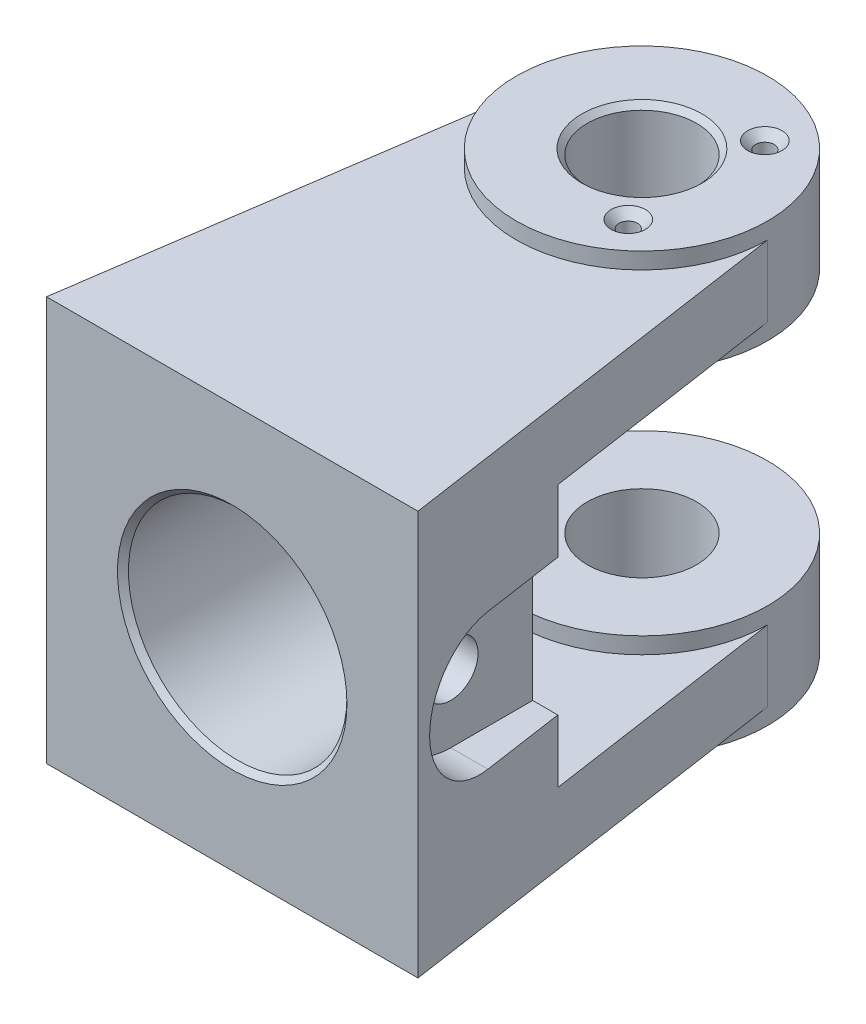
ISO-10303-21;
HEADER;
FILE_DESCRIPTION(('STEP AP214'),'2;1');
FILE_NAME('part.step','',(''),(''),'','','');
FILE_SCHEMA(('AUTOMOTIVE_DESIGN { 1 0 10303 214 1 1 1 1 }'));
ENDSEC;
DATA;
#1=APPLICATION_CONTEXT('core data for automotive mechanical design processes');
#2=APPLICATION_PROTOCOL_DEFINITION('international standard','automotive_design',2000,#1);
#3=PRODUCT_CONTEXT('',#1,'mechanical');
#4=PRODUCT('Part','Part','',(#3));
#5=PRODUCT_RELATED_PRODUCT_CATEGORY('part','',(#4));
#6=PRODUCT_DEFINITION_FORMATION('','',#4);
#7=PRODUCT_DEFINITION_CONTEXT('part definition',#1,'design');
#8=PRODUCT_DEFINITION('design','',#6,#7);
#9=PRODUCT_DEFINITION_SHAPE('','',#8);
#10=(LENGTH_UNIT() NAMED_UNIT(*) SI_UNIT(.MILLI.,.METRE.));
#11=(NAMED_UNIT(*) PLANE_ANGLE_UNIT() SI_UNIT($,.RADIAN.));
#12=(NAMED_UNIT(*) SI_UNIT($,.STERADIAN.) SOLID_ANGLE_UNIT());
#13=UNCERTAINTY_MEASURE_WITH_UNIT(LENGTH_MEASURE(1.E-05),#10,'distance_accuracy_value','');
#14=(GEOMETRIC_REPRESENTATION_CONTEXT(3) GLOBAL_UNCERTAINTY_ASSIGNED_CONTEXT((#13)) GLOBAL_UNIT_ASSIGNED_CONTEXT((#10,
#11,#12)) REPRESENTATION_CONTEXT('',''));
#15=CARTESIAN_POINT('',(0.,0.,0.));
#16=DIRECTION('',(0.,0.,1.));
#17=DIRECTION('',(1.,0.,0.));
#18=AXIS2_PLACEMENT_3D('',#15,#16,#17);
#19=CARTESIAN_POINT('',(22.5156630699617,6.5,-3.30229725026105));
#20=DIRECTION('',(0.989414914283705,0.,-0.145114187428277));
#21=DIRECTION('',(-0.145114187428277,0.,-0.989414914283705));
#22=AXIS2_PLACEMENT_3D('',#19,#20,#21);
#23=PLANE('',#22);
#24=DIRECTION('',(0.,-1.,0.));
#25=VECTOR('',#24,1.);
#26=CARTESIAN_POINT('',(29.6,30.5,45.));
#27=LINE('',#26,#25);
#28=CARTESIAN_POINT('',(29.6,17.9999999999723,45.0000000000159));
#29=VERTEX_POINT('',#28);
#30=CARTESIAN_POINT('',(29.6,6.5,45.));
#31=VERTEX_POINT('',#30);
#32=EDGE_CURVE('E67',#29,#31,#27,.T.);
#33=ORIENTED_EDGE('',*,*,#32,.F.);
#34=DIRECTION('',(0.145114187428277,0.,0.989414914283705));
#35=VECTOR('',#34,1.);
#36=CARTESIAN_POINT('',(22.5156630699617,17.9999999999723,-3.30229725026105));
#37=LINE('',#36,#35);
#38=CARTESIAN_POINT('',(31.8000000000003,18.,60.0000000000023));
#39=VERTEX_POINT('',#38);
#40=EDGE_CURVE('E178',#29,#39,#37,.T.);
#41=ORIENTED_EDGE('',*,*,#40,.T.);
#42=CARTESIAN_POINT('',(31.8,30.5,60.));
#43=DIRECTION('',(0.989414914283705,0.,-0.145114187428277));
#44=DIRECTION('',(0.145114187428277,0.,0.989414914283705));
#45=AXIS2_PLACEMENT_3D('',#42,#43,#44);
#46=ELLIPSE('',#45,12.6337291054982,12.5);
#47=CARTESIAN_POINT('',(31.8000000000003,43.0000000000064,60.0000000000023));
#48=VERTEX_POINT('',#47);
#49=EDGE_CURVE('E161',#48,#39,#46,.T.);
#50=ORIENTED_EDGE('',*,*,#49,.F.);
#51=DIRECTION('',(0.145114187428277,0.,0.989414914283705));
#52=VECTOR('',#51,1.);
#53=CARTESIAN_POINT('',(22.5156630699617,43.0000000000064,-3.30229725026105));
#54=LINE('',#53,#52);
#55=CARTESIAN_POINT('',(29.6,43.0000000000064,45.0000000000159));
#56=VERTEX_POINT('',#55);
#57=EDGE_CURVE('E162',#56,#48,#54,.T.);
#58=ORIENTED_EDGE('',*,*,#57,.F.);
#59=CARTESIAN_POINT('',(29.6,54.5,45.));
#60=VERTEX_POINT('',#59);
#61=EDGE_CURVE('E266',#60,#56,#27,.T.);
#62=ORIENTED_EDGE('',*,*,#61,.F.);
#63=DIRECTION('',(0.145114187428277,0.,0.989414914283705));
#64=VECTOR('',#63,1.);
#65=CARTESIAN_POINT('',(22.5156630699617,54.5,-3.30229725026105));
#66=LINE('',#65,#64);
#67=CARTESIAN_POINT('',(23.,54.5,0.));
#68=VERTEX_POINT('',#67);
#69=EDGE_CURVE('E219',#68,#60,#66,.T.);
#70=ORIENTED_EDGE('',*,*,#69,.F.);
#71=DIRECTION('',(0.,1.,0.));
#72=VECTOR('',#71,1.);
#73=CARTESIAN_POINT('',(23.,54.5,0.));
#74=LINE('',#73,#72);
#75=CARTESIAN_POINT('',(23.,67.5,0.));
#76=VERTEX_POINT('',#75);
#77=EDGE_CURVE('E222',#68,#76,#74,.T.);
#78=ORIENTED_EDGE('',*,*,#77,.T.);
#79=DIRECTION('',(0.145114187428277,0.,0.989414914283705));
#80=VECTOR('',#79,1.);
#81=CARTESIAN_POINT('',(22.5156630699617,67.5,-3.30229725026105));
#82=LINE('',#81,#80);
#83=CARTESIAN_POINT('',(34.,67.5,75.));
#84=VERTEX_POINT('',#83);
#85=EDGE_CURVE('E216',#76,#84,#82,.T.);
#86=ORIENTED_EDGE('',*,*,#85,.T.);
#87=DIRECTION('',(0.,-1.,0.));
#88=VECTOR('',#87,1.);
#89=CARTESIAN_POINT('',(34.,6.5,75.));
#90=LINE('',#89,#88);
#91=CARTESIAN_POINT('',(34.,-6.5,75.));
#92=VERTEX_POINT('',#91);
#93=EDGE_CURVE('E300',#84,#92,#90,.T.);
#94=ORIENTED_EDGE('',*,*,#93,.T.);
#95=DIRECTION('',(0.145114187428277,0.,0.989414914283705));
#96=VECTOR('',#95,1.);
#97=CARTESIAN_POINT('',(22.5156630699617,-6.5,-3.30229725026105));
#98=LINE('',#97,#96);
#99=CARTESIAN_POINT('',(23.,-6.5,0.));
#100=VERTEX_POINT('',#99);
#101=EDGE_CURVE('E282',#100,#92,#98,.T.);
#102=ORIENTED_EDGE('',*,*,#101,.F.);
#103=DIRECTION('',(0.,-1.,0.));
#104=VECTOR('',#103,1.);
#105=CARTESIAN_POINT('',(23.,6.5,0.));
#106=LINE('',#105,#104);
#107=CARTESIAN_POINT('',(23.,6.5,0.));
#108=VERTEX_POINT('',#107);
#109=EDGE_CURVE('E288',#108,#100,#106,.T.);
#110=ORIENTED_EDGE('',*,*,#109,.F.);
#111=DIRECTION('',(0.145114187428277,0.,0.989414914283705));
#112=VECTOR('',#111,1.);
#113=CARTESIAN_POINT('',(22.5156630699617,6.5,-3.30229725026105));
#114=LINE('',#113,#112);
#115=EDGE_CURVE('E285',#108,#31,#114,.T.);
#116=ORIENTED_EDGE('',*,*,#115,.T.);
#117=EDGE_LOOP('',(#33,#41,#50,#58,#62,#70,#78,#86,#94,#102,#110,#116));
#118=FACE_BOUND('',#117,.T.);
#119=ADVANCED_FACE('F43',(#118),#23,.T.);
#120=CARTESIAN_POINT('',(-29.6,30.5,45.));
#121=DIRECTION('',(0.,0.,1.));
#122=DIRECTION('',(1.,0.,0.));
#123=AXIS2_PLACEMENT_3D('',#120,#121,#122);
#124=PLANE('',#123);
#125=CARTESIAN_POINT('',(0.,30.5,45.));
#126=DIRECTION('',(0.,0.,1.));
#127=DIRECTION('',(1.,0.,0.));
#128=AXIS2_PLACEMENT_3D('',#125,#126,#127);
#129=CIRCLE('',#128,20.);
#130=CARTESIAN_POINT('',(20.,30.5,45.));
#131=VERTEX_POINT('',#130);
#132=EDGE_CURVE('E180',#131,#131,#129,.T.);
#133=ORIENTED_EDGE('',*,*,#132,.T.);
#134=EDGE_LOOP('',(#133));
#135=FACE_BOUND('',#134,.T.);
#136=DIRECTION('',(1.,0.,0.));
#137=VECTOR('',#136,1.);
#138=CARTESIAN_POINT('',(25.,17.9999999999723,45.0000000000159));
#139=LINE('',#138,#137);
#140=CARTESIAN_POINT('',(25.,17.9999999999723,45.));
#141=VERTEX_POINT('',#140);
#142=EDGE_CURVE('E150',#141,#29,#139,.T.);
#143=ORIENTED_EDGE('',*,*,#142,.T.);
#144=ORIENTED_EDGE('',*,*,#32,.T.);
#145=DIRECTION('',(-1.,0.,0.));
#146=VECTOR('',#145,1.);
#147=CARTESIAN_POINT('',(-29.6,6.5,45.));
#148=LINE('',#147,#146);
#149=CARTESIAN_POINT('',(-29.6,6.5,45.));
#150=VERTEX_POINT('',#149);
#151=EDGE_CURVE('E261',#31,#150,#148,.T.);
#152=ORIENTED_EDGE('',*,*,#151,.T.);
#153=DIRECTION('',(0.,-1.,0.));
#154=VECTOR('',#153,1.);
#155=CARTESIAN_POINT('',(-29.6,30.5,45.));
#156=LINE('',#155,#154);
#157=CARTESIAN_POINT('',(-29.6,54.5,45.));
#158=VERTEX_POINT('',#157);
#159=EDGE_CURVE('E263',#158,#150,#156,.T.);
#160=ORIENTED_EDGE('',*,*,#159,.F.);
#161=DIRECTION('',(-1.,0.,0.));
#162=VECTOR('',#161,1.);
#163=CARTESIAN_POINT('',(-29.6,54.5,45.));
#164=LINE('',#163,#162);
#165=EDGE_CURVE('E199',#60,#158,#164,.T.);
#166=ORIENTED_EDGE('',*,*,#165,.F.);
#167=ORIENTED_EDGE('',*,*,#61,.T.);
#168=DIRECTION('',(1.,0.,0.));
#169=VECTOR('',#168,1.);
#170=CARTESIAN_POINT('',(25.,43.0000000000064,45.0000000000159));
#171=LINE('',#170,#169);
#172=CARTESIAN_POINT('',(25.,43.0000000000064,45.0000000000159));
#173=VERTEX_POINT('',#172);
#174=EDGE_CURVE('E174',#173,#56,#171,.T.);
#175=ORIENTED_EDGE('',*,*,#174,.F.);
#176=DIRECTION('',(0.,1.,0.));
#177=VECTOR('',#176,1.);
#178=CARTESIAN_POINT('',(25.,-291528.8,45.0000000000159));
#179=LINE('',#178,#177);
#180=EDGE_CURVE('E168',#141,#173,#179,.T.);
#181=ORIENTED_EDGE('',*,*,#180,.F.);
#182=EDGE_LOOP('',(#143,#144,#152,#160,#166,#167,#175,#181));
#183=FACE_BOUND('',#182,.T.);
#184=ADVANCED_FACE('F331',(#135,#183),#124,.F.);
#185=CARTESIAN_POINT('',(0.,-9.5,0.));
#186=DIRECTION('',(0.,1.,0.));
#187=DIRECTION('',(0.,0.,1.));
#188=AXIS2_PLACEMENT_3D('',#185,#186,#187);
#189=PLANE('',#188);
#190=CARTESIAN_POINT('',(9.99999999999999,-9.5,-12.5));
#191=DIRECTION('',(0.,-1.,0.));
#192=DIRECTION('',(0.,0.,-1.));
#193=AXIS2_PLACEMENT_3D('',#190,#191,#192);
#194=CIRCLE('',#193,3.15);
#195=CARTESIAN_POINT('',(9.99999999999999,-9.5,-15.65));
#196=VERTEX_POINT('',#195);
#197=EDGE_CURVE('E243',#196,#196,#194,.T.);
#198=ORIENTED_EDGE('',*,*,#197,.F.);
#199=EDGE_LOOP('',(#198));
#200=FACE_BOUND('',#199,.T.);
#201=CARTESIAN_POINT('',(0.,-9.5,0.));
#202=DIRECTION('',(0.,1.,0.));
#203=DIRECTION('',(0.,0.,1.));
#204=AXIS2_PLACEMENT_3D('',#201,#202,#203);
#205=CIRCLE('',#204,11.);
#206=CARTESIAN_POINT('',(0.,-9.5,11.));
#207=VERTEX_POINT('',#206);
#208=EDGE_CURVE('E307',#207,#207,#205,.T.);
#209=ORIENTED_EDGE('',*,*,#208,.T.);
#210=EDGE_LOOP('',(#209));
#211=FACE_BOUND('',#210,.T.);
#212=CARTESIAN_POINT('',(0.,-9.5,0.));
#213=DIRECTION('',(0.,1.,0.));
#214=DIRECTION('',(0.,0.,1.));
#215=AXIS2_PLACEMENT_3D('',#212,#213,#214);
#216=CIRCLE('',#215,23.);
#217=CARTESIAN_POINT('',(0.,-9.5,23.));
#218=VERTEX_POINT('',#217);
#219=EDGE_CURVE('E272',#218,#218,#216,.T.);
#220=ORIENTED_EDGE('',*,*,#219,.F.);
#221=EDGE_LOOP('',(#220));
#222=FACE_BOUND('',#221,.T.);
#223=CARTESIAN_POINT('',(9.99999999999999,-9.5,12.5));
#224=DIRECTION('',(0.,-1.,0.));
#225=DIRECTION('',(0.,0.,-1.));
#226=AXIS2_PLACEMENT_3D('',#223,#224,#225);
#227=CIRCLE('',#226,3.15);
#228=CARTESIAN_POINT('',(9.99999999999999,-9.5,9.35));
#229=VERTEX_POINT('',#228);
#230=EDGE_CURVE('E252',#229,#229,#227,.T.);
#231=ORIENTED_EDGE('',*,*,#230,.F.);
#232=EDGE_LOOP('',(#231));
#233=FACE_BOUND('',#232,.T.);
#234=ADVANCED_FACE('F337',(#200,#211,#222,#233),#189,.F.);
#235=CARTESIAN_POINT('',(0.,6.5,0.));
#236=DIRECTION('',(0.,1.,0.));
#237=DIRECTION('',(0.,0.,1.));
#238=AXIS2_PLACEMENT_3D('',#235,#236,#237);
#239=PLANE('',#238);
#240=DIRECTION('',(-0.145114187428277,0.,0.989414914283705));
#241=VECTOR('',#240,1.);
#242=CARTESIAN_POINT('',(-22.5156630699617,6.5,-3.30229725026105));
#243=LINE('',#242,#241);
#244=CARTESIAN_POINT('',(-23.,6.5,0.));
#245=VERTEX_POINT('',#244);
#246=EDGE_CURVE('E281',#245,#150,#243,.T.);
#247=ORIENTED_EDGE('',*,*,#246,.T.);
#248=ORIENTED_EDGE('',*,*,#151,.F.);
#249=ORIENTED_EDGE('',*,*,#115,.F.);
#250=CARTESIAN_POINT('',(0.,6.5,0.));
#251=DIRECTION('',(0.,1.,0.));
#252=DIRECTION('',(0.,0.,1.));
#253=AXIS2_PLACEMENT_3D('',#250,#251,#252);
#254=CIRCLE('',#253,23.);
#255=EDGE_CURVE('E279',#245,#108,#254,.T.);
#256=ORIENTED_EDGE('',*,*,#255,.F.);
#257=EDGE_LOOP('',(#247,#248,#249,#256));
#258=FACE_BOUND('',#257,.T.);
#259=ADVANCED_FACE('F350',(#258),#239,.T.);
#260=CARTESIAN_POINT('',(-22.5156630699617,6.5,-3.30229725026105));
#261=DIRECTION('',(0.989414914283705,0.,0.145114187428277));
#262=DIRECTION('',(0.145114187428277,0.,-0.989414914283705));
#263=AXIS2_PLACEMENT_3D('',#260,#261,#262);
#264=PLANE('',#263);
#265=DIRECTION('',(-0.145114187428277,0.,0.989414914283705));
#266=VECTOR('',#265,1.);
#267=CARTESIAN_POINT('',(-22.5156630699617,-6.5,-3.30229725026105));
#268=LINE('',#267,#266);
#269=CARTESIAN_POINT('',(-23.,-6.5,0.));
#270=VERTEX_POINT('',#269);
#271=CARTESIAN_POINT('',(-34.,-6.5,75.));
#272=VERTEX_POINT('',#271);
#273=EDGE_CURVE('E291',#270,#272,#268,.T.);
#274=ORIENTED_EDGE('',*,*,#273,.T.);
#275=DIRECTION('',(0.,-1.,0.));
#276=VECTOR('',#275,1.);
#277=CARTESIAN_POINT('',(-34.,6.5,75.));
#278=LINE('',#277,#276);
#279=CARTESIAN_POINT('',(-34.,67.5,75.));
#280=VERTEX_POINT('',#279);
#281=EDGE_CURVE('E302',#280,#272,#278,.T.);
#282=ORIENTED_EDGE('',*,*,#281,.F.);
#283=DIRECTION('',(-0.145114187428277,0.,0.989414914283705));
#284=VECTOR('',#283,1.);
#285=CARTESIAN_POINT('',(-22.5156630699617,67.5,-3.30229725026105));
#286=LINE('',#285,#284);
#287=CARTESIAN_POINT('',(-23.,67.5,0.));
#288=VERTEX_POINT('',#287);
#289=EDGE_CURVE('E224',#288,#280,#286,.T.);
#290=ORIENTED_EDGE('',*,*,#289,.F.);
#291=DIRECTION('',(0.,1.,0.));
#292=VECTOR('',#291,1.);
#293=CARTESIAN_POINT('',(-23.,54.5,0.));
#294=LINE('',#293,#292);
#295=CARTESIAN_POINT('',(-23.,54.5,0.));
#296=VERTEX_POINT('',#295);
#297=EDGE_CURVE('E234',#296,#288,#294,.T.);
#298=ORIENTED_EDGE('',*,*,#297,.F.);
#299=DIRECTION('',(-0.145114187428277,0.,0.989414914283705));
#300=VECTOR('',#299,1.);
#301=CARTESIAN_POINT('',(-22.5156630699617,54.5,-3.30229725026105));
#302=LINE('',#301,#300);
#303=EDGE_CURVE('E215',#296,#158,#302,.T.);
#304=ORIENTED_EDGE('',*,*,#303,.T.);
#305=ORIENTED_EDGE('',*,*,#159,.T.);
#306=ORIENTED_EDGE('',*,*,#246,.F.);
#307=DIRECTION('',(0.,-1.,0.));
#308=VECTOR('',#307,1.);
#309=CARTESIAN_POINT('',(-23.,6.5,0.));
#310=LINE('',#309,#308);
#311=EDGE_CURVE('E304',#245,#270,#310,.T.);
#312=ORIENTED_EDGE('',*,*,#311,.T.);
#313=EDGE_LOOP('',(#274,#282,#290,#298,#304,#305,#306,#312));
#314=FACE_BOUND('',#313,.T.);
#315=ADVANCED_FACE('F347',(#314),#264,.F.);
#316=CARTESIAN_POINT('',(0.,6.5,75.));
#317=DIRECTION('',(0.,0.,1.));
#318=DIRECTION('',(1.,0.,0.));
#319=AXIS2_PLACEMENT_3D('',#316,#317,#318);
#320=PLANE('',#319);
#321=CARTESIAN_POINT('',(0.,30.5,75.));
#322=DIRECTION('',(0.,0.,1.));
#323=DIRECTION('',(1.,0.,0.));
#324=AXIS2_PLACEMENT_3D('',#321,#322,#323);
#325=CIRCLE('',#324,21.);
#326=CARTESIAN_POINT('',(21.,30.5,75.));
#327=VERTEX_POINT('',#326);
#328=EDGE_CURVE('E11',#327,#327,#325,.F.);
#329=ORIENTED_EDGE('',*,*,#328,.T.);
#330=EDGE_LOOP('',(#329));
#331=FACE_BOUND('',#330,.T.);
#332=DIRECTION('',(-1.,0.,0.));
#333=VECTOR('',#332,1.);
#334=CARTESIAN_POINT('',(0.,-6.5,75.));
#335=LINE('',#334,#333);
#336=EDGE_CURVE('E294',#92,#272,#335,.T.);
#337=ORIENTED_EDGE('',*,*,#336,.F.);
#338=ORIENTED_EDGE('',*,*,#93,.F.);
#339=DIRECTION('',(-1.,0.,0.));
#340=VECTOR('',#339,1.);
#341=CARTESIAN_POINT('',(0.,67.5,75.));
#342=LINE('',#341,#340);
#343=EDGE_CURVE('E227',#84,#280,#342,.T.);
#344=ORIENTED_EDGE('',*,*,#343,.T.);
#345=ORIENTED_EDGE('',*,*,#281,.T.);
#346=EDGE_LOOP('',(#337,#338,#344,#345));
#347=FACE_BOUND('',#346,.T.);
#348=ADVANCED_FACE('F344',(#331,#347),#320,.T.);
#349=CARTESIAN_POINT('',(0.,-6.5,0.));
#350=DIRECTION('',(0.,1.,0.));
#351=DIRECTION('',(0.,0.,1.));
#352=AXIS2_PLACEMENT_3D('',#349,#350,#351);
#353=PLANE('',#352);
#354=CARTESIAN_POINT('',(0.,-6.5,0.));
#355=DIRECTION('',(0.,1.,0.));
#356=DIRECTION('',(0.,0.,1.));
#357=AXIS2_PLACEMENT_3D('',#354,#355,#356);
#358=CIRCLE('',#357,23.);
#359=EDGE_CURVE('E276',#270,#100,#358,.T.);
#360=ORIENTED_EDGE('',*,*,#359,.T.);
#361=ORIENTED_EDGE('',*,*,#101,.T.);
#362=ORIENTED_EDGE('',*,*,#336,.T.);
#363=ORIENTED_EDGE('',*,*,#273,.F.);
#364=EDGE_LOOP('',(#360,#361,#362,#363));
#365=FACE_BOUND('',#364,.T.);
#366=ADVANCED_FACE('F342',(#365),#353,.F.);
#367=CARTESIAN_POINT('',(0.,9.5,0.));
#368=DIRECTION('',(0.,1.,0.));
#369=DIRECTION('',(0.,0.,1.));
#370=AXIS2_PLACEMENT_3D('',#367,#368,#369);
#371=PLANE('',#370);
#372=CARTESIAN_POINT('',(0.,9.5,0.));
#373=DIRECTION('',(0.,1.,0.));
#374=DIRECTION('',(0.,0.,1.));
#375=AXIS2_PLACEMENT_3D('',#372,#373,#374);
#376=CIRCLE('',#375,23.);
#377=CARTESIAN_POINT('',(0.,9.5,23.));
#378=VERTEX_POINT('',#377);
#379=EDGE_CURVE('E273',#378,#378,#376,.T.);
#380=ORIENTED_EDGE('',*,*,#379,.T.);
#381=EDGE_LOOP('',(#380));
#382=FACE_BOUND('',#381,.T.);
#383=CARTESIAN_POINT('',(0.,9.5,0.));
#384=DIRECTION('',(0.,1.,0.));
#385=DIRECTION('',(0.,0.,1.));
#386=AXIS2_PLACEMENT_3D('',#383,#384,#385);
#387=CIRCLE('',#386,10.);
#388=CARTESIAN_POINT('',(0.,9.5,10.));
#389=VERTEX_POINT('',#388);
#390=EDGE_CURVE('E269',#389,#389,#387,.T.);
#391=ORIENTED_EDGE('',*,*,#390,.F.);
#392=EDGE_LOOP('',(#391));
#393=FACE_BOUND('',#392,.T.);
#394=ADVANCED_FACE('F399',(#382,#393),#371,.T.);
#395=CARTESIAN_POINT('',(0.,9.5,0.));
#396=DIRECTION('',(0.,-1.,0.));
#397=DIRECTION('',(0.,0.,-1.));
#398=AXIS2_PLACEMENT_3D('',#395,#396,#397);
#399=CYLINDRICAL_SURFACE('',#398,23.);
#400=ORIENTED_EDGE('',*,*,#255,.T.);
#401=ORIENTED_EDGE('',*,*,#109,.T.);
#402=ORIENTED_EDGE('',*,*,#359,.F.);
#403=ORIENTED_EDGE('',*,*,#311,.F.);
#404=EDGE_LOOP('',(#400,#401,#402,#403));
#405=FACE_BOUND('',#404,.T.);
#406=ORIENTED_EDGE('',*,*,#379,.F.);
#407=EDGE_LOOP('',(#406));
#408=FACE_BOUND('',#407,.T.);
#409=ORIENTED_EDGE('',*,*,#219,.T.);
#410=EDGE_LOOP('',(#409));
#411=FACE_BOUND('',#410,.T.);
#412=ADVANCED_FACE('F367',(#405,#408,#411),#399,.T.);
#413=CARTESIAN_POINT('',(0.,9.5,0.));
#414=DIRECTION('',(0.,-1.,0.));
#415=DIRECTION('',(0.,0.,-1.));
#416=AXIS2_PLACEMENT_3D('',#413,#414,#415);
#417=CYLINDRICAL_SURFACE('',#416,10.);
#418=CARTESIAN_POINT('',(0.,-8.49999999999999,0.));
#419=DIRECTION('',(0.,1.,0.));
#420=DIRECTION('',(0.,0.,1.));
#421=AXIS2_PLACEMENT_3D('',#418,#419,#420);
#422=CIRCLE('',#421,10.);
#423=CARTESIAN_POINT('',(0.,-8.49999999999999,10.));
#424=VERTEX_POINT('',#423);
#425=EDGE_CURVE('E310',#424,#424,#422,.F.);
#426=ORIENTED_EDGE('',*,*,#425,.T.);
#427=EDGE_LOOP('',(#426));
#428=FACE_BOUND('',#427,.T.);
#429=ORIENTED_EDGE('',*,*,#390,.T.);
#430=EDGE_LOOP('',(#429));
#431=FACE_BOUND('',#430,.T.);
#432=ADVANCED_FACE('F358',(#428,#431),#417,.F.);
#433=CARTESIAN_POINT('',(0.,-9.5,0.));
#434=DIRECTION('',(0.,-1.,0.));
#435=DIRECTION('',(0.,0.,-1.));
#436=AXIS2_PLACEMENT_3D('',#433,#434,#435);
#437=CONICAL_SURFACE('',#436,11.,0.785398163397451);
#438=ORIENTED_EDGE('',*,*,#425,.F.);
#439=EDGE_LOOP('',(#438));
#440=FACE_BOUND('',#439,.T.);
#441=ORIENTED_EDGE('',*,*,#208,.F.);
#442=EDGE_LOOP('',(#441));
#443=FACE_BOUND('',#442,.T.);
#444=ADVANCED_FACE('F353',(#440,#443),#437,.F.);
#445=CARTESIAN_POINT('',(9.99999999999999,1.47853694765315,12.5));
#446=DIRECTION('',(0.,-1.,0.));
#447=DIRECTION('',(0.,0.,-1.));
#448=AXIS2_PLACEMENT_3D('',#445,#446,#447);
#449=CONICAL_SURFACE('',#448,1.7,1.02974425867665);
#450=CARTESIAN_POINT('',(9.99999999999999,2.5,12.5));
#451=VERTEX_POINT('',#450);
#452=VERTEX_LOOP('',#451);
#453=FACE_BOUND('',#452,.T.);
#454=CARTESIAN_POINT('',(9.99999999999999,1.47853694765315,12.5));
#455=DIRECTION('',(0.,-1.,0.));
#456=DIRECTION('',(0.,0.,-1.));
#457=AXIS2_PLACEMENT_3D('',#454,#455,#456);
#458=CIRCLE('',#457,1.7);
#459=CARTESIAN_POINT('',(9.99999999999999,1.47853694765315,10.8));
#460=VERTEX_POINT('',#459);
#461=EDGE_CURVE('E258',#460,#460,#458,.T.);
#462=ORIENTED_EDGE('',*,*,#461,.T.);
#463=EDGE_LOOP('',(#462));
#464=FACE_BOUND('',#463,.T.);
#465=ADVANCED_FACE('F357',(#453,#464),#449,.F.);
#466=CARTESIAN_POINT('',(9.99999999999999,-9.5,12.5));
#467=DIRECTION('',(0.,-1.,0.));
#468=DIRECTION('',(0.,0.,-1.));
#469=AXIS2_PLACEMENT_3D('',#466,#467,#468);
#470=CYLINDRICAL_SURFACE('',#469,1.69999999999999);
#471=ORIENTED_EDGE('',*,*,#461,.F.);
#472=EDGE_LOOP('',(#471));
#473=FACE_BOUND('',#472,.T.);
#474=CARTESIAN_POINT('',(9.99999999999999,-8.04999999999999,12.5));
#475=DIRECTION('',(0.,-1.,0.));
#476=DIRECTION('',(0.,0.,-1.));
#477=AXIS2_PLACEMENT_3D('',#474,#475,#476);
#478=CIRCLE('',#477,1.69999999999999);
#479=CARTESIAN_POINT('',(9.99999999999999,-8.04999999999999,10.8));
#480=VERTEX_POINT('',#479);
#481=EDGE_CURVE('E255',#480,#480,#478,.T.);
#482=ORIENTED_EDGE('',*,*,#481,.T.);
#483=EDGE_LOOP('',(#482));
#484=FACE_BOUND('',#483,.T.);
#485=ADVANCED_FACE('F364',(#473,#484),#470,.F.);
#486=CARTESIAN_POINT('',(9.99999999999999,-9.5,12.5));
#487=DIRECTION('',(0.,-1.,0.));
#488=DIRECTION('',(0.,0.,-1.));
#489=AXIS2_PLACEMENT_3D('',#486,#487,#488);
#490=CONICAL_SURFACE('',#489,3.15,0.78539816339745);
#491=ORIENTED_EDGE('',*,*,#481,.F.);
#492=EDGE_LOOP('',(#491));
#493=FACE_BOUND('',#492,.T.);
#494=ORIENTED_EDGE('',*,*,#230,.T.);
#495=EDGE_LOOP('',(#494));
#496=FACE_BOUND('',#495,.T.);
#497=ADVANCED_FACE('F382',(#493,#496),#490,.F.);
#498=CARTESIAN_POINT('',(9.99999999999999,1.47853694765315,-12.5));
#499=DIRECTION('',(0.,-1.,0.));
#500=DIRECTION('',(0.,0.,-1.));
#501=AXIS2_PLACEMENT_3D('',#498,#499,#500);
#502=CONICAL_SURFACE('',#501,1.7,1.02974425867665);
#503=CARTESIAN_POINT('',(9.99999999999999,2.5,-12.5));
#504=VERTEX_POINT('',#503);
#505=VERTEX_LOOP('',#504);
#506=FACE_BOUND('',#505,.T.);
#507=CARTESIAN_POINT('',(9.99999999999999,1.47853694765315,-12.5));
#508=DIRECTION('',(0.,-1.,0.));
#509=DIRECTION('',(0.,0.,-1.));
#510=AXIS2_PLACEMENT_3D('',#507,#508,#509);
#511=CIRCLE('',#510,1.7);
#512=CARTESIAN_POINT('',(9.99999999999999,1.47853694765315,-14.2));
#513=VERTEX_POINT('',#512);
#514=EDGE_CURVE('E249',#513,#513,#511,.T.);
#515=ORIENTED_EDGE('',*,*,#514,.T.);
#516=EDGE_LOOP('',(#515));
#517=FACE_BOUND('',#516,.T.);
#518=ADVANCED_FACE('F384',(#506,#517),#502,.F.);
#519=CARTESIAN_POINT('',(9.99999999999999,-9.5,-12.5));
#520=DIRECTION('',(0.,-1.,0.));
#521=DIRECTION('',(0.,0.,-1.));
#522=AXIS2_PLACEMENT_3D('',#519,#520,#521);
#523=CYLINDRICAL_SURFACE('',#522,1.69999999999999);
#524=ORIENTED_EDGE('',*,*,#514,.F.);
#525=EDGE_LOOP('',(#524));
#526=FACE_BOUND('',#525,.T.);
#527=CARTESIAN_POINT('',(9.99999999999999,-8.04999999999999,-12.5));
#528=DIRECTION('',(0.,-1.,0.));
#529=DIRECTION('',(0.,0.,-1.));
#530=AXIS2_PLACEMENT_3D('',#527,#528,#529);
#531=CIRCLE('',#530,1.69999999999999);
#532=CARTESIAN_POINT('',(9.99999999999999,-8.04999999999999,-14.2));
#533=VERTEX_POINT('',#532);
#534=EDGE_CURVE('E246',#533,#533,#531,.T.);
#535=ORIENTED_EDGE('',*,*,#534,.T.);
#536=EDGE_LOOP('',(#535));
#537=FACE_BOUND('',#536,.T.);
#538=ADVANCED_FACE('F391',(#526,#537),#523,.F.);
#539=CARTESIAN_POINT('',(9.99999999999999,-9.5,-12.5));
#540=DIRECTION('',(0.,-1.,0.));
#541=DIRECTION('',(0.,0.,-1.));
#542=AXIS2_PLACEMENT_3D('',#539,#540,#541);
#543=CONICAL_SURFACE('',#542,3.15,0.78539816339745);
#544=ORIENTED_EDGE('',*,*,#534,.F.);
#545=EDGE_LOOP('',(#544));
#546=FACE_BOUND('',#545,.T.);
#547=ORIENTED_EDGE('',*,*,#197,.T.);
#548=EDGE_LOOP('',(#547));
#549=FACE_BOUND('',#548,.T.);
#550=ADVANCED_FACE('F448',(#546,#549),#543,.F.);
#551=CARTESIAN_POINT('',(0.,70.5,0.));
#552=DIRECTION('',(0.,-1.,0.));
#553=DIRECTION('',(0.,0.,1.));
#554=AXIS2_PLACEMENT_3D('',#551,#552,#553);
#555=PLANE('',#554);
#556=CARTESIAN_POINT('',(9.99999999999999,70.5,-12.5));
#557=DIRECTION('',(0.,-1.,0.));
#558=DIRECTION('',(0.,0.,-1.));
#559=AXIS2_PLACEMENT_3D('',#556,#557,#558);
#560=CIRCLE('',#559,3.15);
#561=CARTESIAN_POINT('',(9.99999999999999,70.5,-15.65));
#562=VERTEX_POINT('',#561);
#563=EDGE_CURVE('E181',#562,#562,#560,.T.);
#564=ORIENTED_EDGE('',*,*,#563,.T.);
#565=EDGE_LOOP('',(#564));
#566=FACE_BOUND('',#565,.T.);
#567=CARTESIAN_POINT('',(0.,70.5,0.));
#568=DIRECTION('',(0.,1.,0.));
#569=DIRECTION('',(0.,0.,1.));
#570=AXIS2_PLACEMENT_3D('',#567,#568,#569);
#571=CIRCLE('',#570,11.);
#572=CARTESIAN_POINT('',(0.,70.5,11.));
#573=VERTEX_POINT('',#572);
#574=EDGE_CURVE('E237',#573,#573,#571,.T.);
#575=ORIENTED_EDGE('',*,*,#574,.F.);
#576=EDGE_LOOP('',(#575));
#577=FACE_BOUND('',#576,.T.);
#578=CARTESIAN_POINT('',(0.,70.5,0.));
#579=DIRECTION('',(0.,1.,0.));
#580=DIRECTION('',(0.,0.,1.));
#581=AXIS2_PLACEMENT_3D('',#578,#579,#580);
#582=CIRCLE('',#581,23.);
#583=CARTESIAN_POINT('',(0.,70.5,23.));
#584=VERTEX_POINT('',#583);
#585=EDGE_CURVE('E205',#584,#584,#582,.T.);
#586=ORIENTED_EDGE('',*,*,#585,.T.);
#587=EDGE_LOOP('',(#586));
#588=FACE_BOUND('',#587,.T.);
#589=CARTESIAN_POINT('',(9.99999999999999,70.5,12.5));
#590=DIRECTION('',(0.,-1.,0.));
#591=DIRECTION('',(0.,0.,-1.));
#592=AXIS2_PLACEMENT_3D('',#589,#590,#591);
#593=CIRCLE('',#592,3.15);
#594=CARTESIAN_POINT('',(9.99999999999999,70.5,9.35));
#595=VERTEX_POINT('',#594);
#596=EDGE_CURVE('E190',#595,#595,#593,.T.);
#597=ORIENTED_EDGE('',*,*,#596,.T.);
#598=EDGE_LOOP('',(#597));
#599=FACE_BOUND('',#598,.T.);
#600=ADVANCED_FACE('F445',(#566,#577,#588,#599),#555,.F.);
#601=CARTESIAN_POINT('',(0.,54.5,0.));
#602=DIRECTION('',(0.,-1.,0.));
#603=DIRECTION('',(0.,0.,1.));
#604=AXIS2_PLACEMENT_3D('',#601,#602,#603);
#605=PLANE('',#604);
#606=ORIENTED_EDGE('',*,*,#303,.F.);
#607=CARTESIAN_POINT('',(0.,54.5,0.));
#608=DIRECTION('',(0.,1.,0.));
#609=DIRECTION('',(0.,0.,1.));
#610=AXIS2_PLACEMENT_3D('',#607,#608,#609);
#611=CIRCLE('',#610,23.);
#612=EDGE_CURVE('E212',#296,#68,#611,.T.);
#613=ORIENTED_EDGE('',*,*,#612,.T.);
#614=ORIENTED_EDGE('',*,*,#69,.T.);
#615=ORIENTED_EDGE('',*,*,#165,.T.);
#616=EDGE_LOOP('',(#606,#613,#614,#615));
#617=FACE_BOUND('',#616,.T.);
#618=ADVANCED_FACE('F416',(#617),#605,.T.);
#619=CARTESIAN_POINT('',(0.,67.5,0.));
#620=DIRECTION('',(0.,-1.,0.));
#621=DIRECTION('',(0.,0.,1.));
#622=AXIS2_PLACEMENT_3D('',#619,#620,#621);
#623=PLANE('',#622);
#624=CARTESIAN_POINT('',(0.,67.5,0.));
#625=DIRECTION('',(0.,1.,0.));
#626=DIRECTION('',(0.,0.,1.));
#627=AXIS2_PLACEMENT_3D('',#624,#625,#626);
#628=CIRCLE('',#627,23.);
#629=EDGE_CURVE('E209',#288,#76,#628,.T.);
#630=ORIENTED_EDGE('',*,*,#629,.F.);
#631=ORIENTED_EDGE('',*,*,#289,.T.);
#632=ORIENTED_EDGE('',*,*,#343,.F.);
#633=ORIENTED_EDGE('',*,*,#85,.F.);
#634=EDGE_LOOP('',(#630,#631,#632,#633));
#635=FACE_BOUND('',#634,.T.);
#636=ADVANCED_FACE('F433',(#635),#623,.F.);
#637=CARTESIAN_POINT('',(0.,51.5,0.));
#638=DIRECTION('',(0.,-1.,0.));
#639=DIRECTION('',(0.,0.,1.));
#640=AXIS2_PLACEMENT_3D('',#637,#638,#639);
#641=PLANE('',#640);
#642=CARTESIAN_POINT('',(0.,51.5,0.));
#643=DIRECTION('',(0.,1.,0.));
#644=DIRECTION('',(0.,0.,1.));
#645=AXIS2_PLACEMENT_3D('',#642,#643,#644);
#646=CIRCLE('',#645,23.);
#647=CARTESIAN_POINT('',(0.,51.5,23.));
#648=VERTEX_POINT('',#647);
#649=EDGE_CURVE('E206',#648,#648,#646,.T.);
#650=ORIENTED_EDGE('',*,*,#649,.F.);
#651=EDGE_LOOP('',(#650));
#652=FACE_BOUND('',#651,.T.);
#653=CARTESIAN_POINT('',(0.,51.5,0.));
#654=DIRECTION('',(0.,1.,0.));
#655=DIRECTION('',(0.,0.,1.));
#656=AXIS2_PLACEMENT_3D('',#653,#654,#655);
#657=CIRCLE('',#656,10.);
#658=CARTESIAN_POINT('',(0.,51.5,10.));
#659=VERTEX_POINT('',#658);
#660=EDGE_CURVE('E202',#659,#659,#657,.T.);
#661=ORIENTED_EDGE('',*,*,#660,.T.);
#662=EDGE_LOOP('',(#661));
#663=FACE_BOUND('',#662,.T.);
#664=ADVANCED_FACE('F439',(#652,#663),#641,.T.);
#665=CARTESIAN_POINT('',(0.,51.5,0.));
#666=DIRECTION('',(0.,1.,0.));
#667=DIRECTION('',(0.,0.,-1.));
#668=AXIS2_PLACEMENT_3D('',#665,#666,#667);
#669=CYLINDRICAL_SURFACE('',#668,23.);
#670=ORIENTED_EDGE('',*,*,#612,.F.);
#671=ORIENTED_EDGE('',*,*,#297,.T.);
#672=ORIENTED_EDGE('',*,*,#629,.T.);
#673=ORIENTED_EDGE('',*,*,#77,.F.);
#674=EDGE_LOOP('',(#670,#671,#672,#673));
#675=FACE_BOUND('',#674,.T.);
#676=ORIENTED_EDGE('',*,*,#649,.T.);
#677=EDGE_LOOP('',(#676));
#678=FACE_BOUND('',#677,.T.);
#679=ORIENTED_EDGE('',*,*,#585,.F.);
#680=EDGE_LOOP('',(#679));
#681=FACE_BOUND('',#680,.T.);
#682=ADVANCED_FACE('F435',(#675,#678,#681),#669,.T.);
#683=CARTESIAN_POINT('',(0.,51.5,0.));
#684=DIRECTION('',(0.,1.,0.));
#685=DIRECTION('',(0.,0.,-1.));
#686=AXIS2_PLACEMENT_3D('',#683,#684,#685);
#687=CYLINDRICAL_SURFACE('',#686,10.);
#688=CARTESIAN_POINT('',(0.,69.5,0.));
#689=DIRECTION('',(0.,1.,0.));
#690=DIRECTION('',(0.,0.,1.));
#691=AXIS2_PLACEMENT_3D('',#688,#689,#690);
#692=CIRCLE('',#691,10.);
#693=CARTESIAN_POINT('',(0.,69.5,10.));
#694=VERTEX_POINT('',#693);
#695=EDGE_CURVE('E240',#694,#694,#692,.F.);
#696=ORIENTED_EDGE('',*,*,#695,.F.);
#697=EDGE_LOOP('',(#696));
#698=FACE_BOUND('',#697,.T.);
#699=ORIENTED_EDGE('',*,*,#660,.F.);
#700=EDGE_LOOP('',(#699));
#701=FACE_BOUND('',#700,.T.);
#702=ADVANCED_FACE('F438',(#698,#701),#687,.F.);
#703=CARTESIAN_POINT('',(0.,70.5,0.));
#704=DIRECTION('',(0.,1.,0.));
#705=DIRECTION('',(0.,0.,-1.));
#706=AXIS2_PLACEMENT_3D('',#703,#704,#705);
#707=CONICAL_SURFACE('',#706,11.,0.785398163397451);
#708=ORIENTED_EDGE('',*,*,#695,.T.);
#709=EDGE_LOOP('',(#708));
#710=FACE_BOUND('',#709,.T.);
#711=ORIENTED_EDGE('',*,*,#574,.T.);
#712=EDGE_LOOP('',(#711));
#713=FACE_BOUND('',#712,.T.);
#714=ADVANCED_FACE('F473',(#710,#713),#707,.F.);
#715=CARTESIAN_POINT('',(9.99999999999999,59.5214630523469,12.5));
#716=DIRECTION('',(0.,1.,0.));
#717=DIRECTION('',(0.,0.,-1.));
#718=AXIS2_PLACEMENT_3D('',#715,#716,#717);
#719=CONICAL_SURFACE('',#718,1.7,1.02974425867665);
#720=CARTESIAN_POINT('',(9.99999999999999,58.5,12.5));
#721=VERTEX_POINT('',#720);
#722=VERTEX_LOOP('',#721);
#723=FACE_BOUND('',#722,.T.);
#724=CARTESIAN_POINT('',(9.99999999999999,59.5214630523469,12.5));
#725=DIRECTION('',(0.,-1.,0.));
#726=DIRECTION('',(0.,0.,-1.));
#727=AXIS2_PLACEMENT_3D('',#724,#725,#726);
#728=CIRCLE('',#727,1.7);
#729=CARTESIAN_POINT('',(9.99999999999999,59.5214630523469,10.8));
#730=VERTEX_POINT('',#729);
#731=EDGE_CURVE('E196',#730,#730,#728,.T.);
#732=ORIENTED_EDGE('',*,*,#731,.F.);
#733=EDGE_LOOP('',(#732));
#734=FACE_BOUND('',#733,.T.);
#735=ADVANCED_FACE('F466',(#723,#734),#719,.F.);
#736=CARTESIAN_POINT('',(9.99999999999999,70.5,12.5));
#737=DIRECTION('',(0.,1.,0.));
#738=DIRECTION('',(0.,0.,-1.));
#739=AXIS2_PLACEMENT_3D('',#736,#737,#738);
#740=CYLINDRICAL_SURFACE('',#739,1.69999999999999);
#741=ORIENTED_EDGE('',*,*,#731,.T.);
#742=EDGE_LOOP('',(#741));
#743=FACE_BOUND('',#742,.T.);
#744=CARTESIAN_POINT('',(9.99999999999999,69.05,12.5));
#745=DIRECTION('',(0.,-1.,0.));
#746=DIRECTION('',(0.,0.,-1.));
#747=AXIS2_PLACEMENT_3D('',#744,#745,#746);
#748=CIRCLE('',#747,1.69999999999999);
#749=CARTESIAN_POINT('',(9.99999999999999,69.05,10.8));
#750=VERTEX_POINT('',#749);
#751=EDGE_CURVE('E193',#750,#750,#748,.T.);
#752=ORIENTED_EDGE('',*,*,#751,.F.);
#753=EDGE_LOOP('',(#752));
#754=FACE_BOUND('',#753,.T.);
#755=ADVANCED_FACE('F456',(#743,#754),#740,.F.);
#756=CARTESIAN_POINT('',(9.99999999999999,70.5,12.5));
#757=DIRECTION('',(0.,1.,0.));
#758=DIRECTION('',(0.,0.,-1.));
#759=AXIS2_PLACEMENT_3D('',#756,#757,#758);
#760=CONICAL_SURFACE('',#759,3.15,0.78539816339745);
#761=ORIENTED_EDGE('',*,*,#751,.T.);
#762=EDGE_LOOP('',(#761));
#763=FACE_BOUND('',#762,.T.);
#764=ORIENTED_EDGE('',*,*,#596,.F.);
#765=EDGE_LOOP('',(#764));
#766=FACE_BOUND('',#765,.T.);
#767=ADVANCED_FACE('F453',(#763,#766),#760,.F.);
#768=CARTESIAN_POINT('',(9.99999999999999,59.5214630523469,-12.5));
#769=DIRECTION('',(0.,1.,0.));
#770=DIRECTION('',(0.,0.,-1.));
#771=AXIS2_PLACEMENT_3D('',#768,#769,#770);
#772=CONICAL_SURFACE('',#771,1.7,1.02974425867665);
#773=CARTESIAN_POINT('',(9.99999999999999,58.5,-12.5));
#774=VERTEX_POINT('',#773);
#775=VERTEX_LOOP('',#774);
#776=FACE_BOUND('',#775,.T.);
#777=CARTESIAN_POINT('',(9.99999999999999,59.5214630523469,-12.5));
#778=DIRECTION('',(0.,-1.,0.));
#779=DIRECTION('',(0.,0.,-1.));
#780=AXIS2_PLACEMENT_3D('',#777,#778,#779);
#781=CIRCLE('',#780,1.7);
#782=CARTESIAN_POINT('',(9.99999999999999,59.5214630523469,-14.2));
#783=VERTEX_POINT('',#782);
#784=EDGE_CURVE('E187',#783,#783,#781,.T.);
#785=ORIENTED_EDGE('',*,*,#784,.F.);
#786=EDGE_LOOP('',(#785));
#787=FACE_BOUND('',#786,.T.);
#788=ADVANCED_FACE('F455',(#776,#787),#772,.F.);
#789=CARTESIAN_POINT('',(9.99999999999999,70.5,-12.5));
#790=DIRECTION('',(0.,1.,0.));
#791=DIRECTION('',(0.,0.,-1.));
#792=AXIS2_PLACEMENT_3D('',#789,#790,#791);
#793=CYLINDRICAL_SURFACE('',#792,1.69999999999999);
#794=ORIENTED_EDGE('',*,*,#784,.T.);
#795=EDGE_LOOP('',(#794));
#796=FACE_BOUND('',#795,.T.);
#797=CARTESIAN_POINT('',(9.99999999999999,69.05,-12.5));
#798=DIRECTION('',(0.,-1.,0.));
#799=DIRECTION('',(0.,0.,-1.));
#800=AXIS2_PLACEMENT_3D('',#797,#798,#799);
#801=CIRCLE('',#800,1.69999999999999);
#802=CARTESIAN_POINT('',(9.99999999999999,69.05,-14.2));
#803=VERTEX_POINT('',#802);
#804=EDGE_CURVE('E184',#803,#803,#801,.T.);
#805=ORIENTED_EDGE('',*,*,#804,.F.);
#806=EDGE_LOOP('',(#805));
#807=FACE_BOUND('',#806,.T.);
#808=ADVANCED_FACE('F463',(#796,#807),#793,.F.);
#809=CARTESIAN_POINT('',(9.99999999999999,70.5,-12.5));
#810=DIRECTION('',(0.,1.,0.));
#811=DIRECTION('',(0.,0.,-1.));
#812=AXIS2_PLACEMENT_3D('',#809,#810,#811);
#813=CONICAL_SURFACE('',#812,3.15,0.78539816339745);
#814=ORIENTED_EDGE('',*,*,#804,.T.);
#815=EDGE_LOOP('',(#814));
#816=FACE_BOUND('',#815,.T.);
#817=ORIENTED_EDGE('',*,*,#563,.F.);
#818=EDGE_LOOP('',(#817));
#819=FACE_BOUND('',#818,.T.);
#820=ADVANCED_FACE('F562',(#816,#819),#813,.F.);
#821=CARTESIAN_POINT('',(0.,30.5,-23.));
#822=DIRECTION('',(0.,0.,1.));
#823=DIRECTION('',(1.,0.,0.));
#824=AXIS2_PLACEMENT_3D('',#821,#822,#823);
#825=CYLINDRICAL_SURFACE('',#824,20.);
#826=CARTESIAN_POINT('',(0.,30.5,74.));
#827=DIRECTION('',(0.,0.,1.));
#828=DIRECTION('',(1.,0.,0.));
#829=AXIS2_PLACEMENT_3D('',#826,#827,#828);
#830=CIRCLE('',#829,20.);
#831=CARTESIAN_POINT('',(20.,30.5,74.));
#832=VERTEX_POINT('',#831);
#833=EDGE_CURVE('E52',#832,#832,#830,.T.);
#834=ORIENTED_EDGE('',*,*,#833,.T.);
#835=EDGE_LOOP('',(#834));
#836=FACE_BOUND('',#835,.T.);
#837=CARTESIAN_POINT('',(20.,30.5,55.));
#838=CARTESIAN_POINT('',(19.9999953289338,30.2237463711009,55.0000077524605));
#839=CARTESIAN_POINT('',(19.9942192710609,29.9474061405641,55.0229718359126));
#840=CARTESIAN_POINT('',(19.9717371276631,29.4026455874316,55.11408383769));
#841=CARTESIAN_POINT('',(19.9550248473325,29.1342298437642,55.1822573651262));
#842=CARTESIAN_POINT('',(19.9125208777344,28.6132637593914,55.361464178207));
#843=CARTESIAN_POINT('',(19.8867400947353,28.3606947885667,55.4724459957176));
#844=CARTESIAN_POINT('',(19.8288447935874,27.8777595603186,55.7339379668161));
#845=CARTESIAN_POINT('',(19.7967300618052,27.6473940521708,55.8844494537299));
#846=CARTESIAN_POINT('',(19.7289137863898,27.2106602423303,56.2240026321806));
#847=CARTESIAN_POINT('',(19.6931569049375,27.0048143664631,56.4137052498636));
#848=CARTESIAN_POINT('',(19.6224540039312,26.6275035759889,56.8248406830301));
#849=CARTESIAN_POINT('',(19.5875080763289,26.4560425435027,57.0462770764898));
#850=CARTESIAN_POINT('',(19.5218258566056,26.1499115240034,57.51865075579));
#851=CARTESIAN_POINT('',(19.4911598154937,26.0158259469162,57.7699774360291));
#852=CARTESIAN_POINT('',(19.4383164939339,25.7920103048309,58.2924947055335));
#853=CARTESIAN_POINT('',(19.4161378564806,25.7022731485329,58.5636821111067));
#854=CARTESIAN_POINT('',(19.3833492232108,25.5714838773175,59.1124783273389));
#855=CARTESIAN_POINT('',(19.372516366567,25.5294924388932,59.38984965346));
#856=CARTESIAN_POINT('',(19.3629787486531,25.4924607497786,59.9478952299978));
#857=CARTESIAN_POINT('',(19.3642720142643,25.4974128606063,60.2285689356405));
#858=CARTESIAN_POINT('',(19.3786401838939,25.553378251201,60.7780526924845));
#859=CARTESIAN_POINT('',(19.3914287669098,25.6032721993646,61.0469854048845));
#860=CARTESIAN_POINT('',(19.426890322369,25.74591937699,61.5725368363702));
#861=CARTESIAN_POINT('',(19.4495639989746,25.8386756597687,61.8291546767631));
#862=CARTESIAN_POINT('',(19.5025037968553,26.0653684068761,62.3257933875071));
#863=CARTESIAN_POINT('',(19.5328442489939,26.1997111092236,62.5656205726319));
#864=CARTESIAN_POINT('',(19.5976570281997,26.5054790799502,63.0197290325227));
#865=CARTESIAN_POINT('',(19.6321300778209,26.6769108373039,63.2340058268909));
#866=CARTESIAN_POINT('',(19.7025293513297,27.0577885843959,63.637345385648));
#867=CARTESIAN_POINT('',(19.7384689826,27.2681791394471,63.8255149668712));
#868=CARTESIAN_POINT('',(19.8068655192919,27.7179602749877,64.164070808213));
#869=CARTESIAN_POINT('',(19.8393223183136,27.9573517409735,64.3144559142119));
#870=CARTESIAN_POINT('',(19.897257736473,28.4596137043954,64.5735019540813));
#871=CARTESIAN_POINT('',(19.9227120042576,28.7225620226379,64.6820178008481));
#872=CARTESIAN_POINT('',(19.9635972330472,29.2637466395237,64.8530576856986));
#873=CARTESIAN_POINT('',(19.9790301113094,29.5419800028317,64.9155905213938));
#874=CARTESIAN_POINT('',(19.9978499757125,30.0982000986999,64.9915252185295));
#875=CARTESIAN_POINT('',(20.0015351169426,30.3760109333726,65.006143420251));
#876=CARTESIAN_POINT('',(19.9972934938151,30.9301095826717,64.9891699931484));
#877=CARTESIAN_POINT('',(19.9893677747284,31.2063975321487,64.9575825240029));
#878=CARTESIAN_POINT('',(19.9629860375784,31.7453808959216,64.8500969720288));
#879=CARTESIAN_POINT('',(19.9446878061929,32.0082170632292,64.7748624550768));
#880=CARTESIAN_POINT('',(19.899623554472,32.5175243081751,64.5829763865718));
#881=CARTESIAN_POINT('',(19.8728566789995,32.7639937301088,64.4663206522893));
#882=CARTESIAN_POINT('',(19.8131102642072,33.2384104480994,64.1925462370844));
#883=CARTESIAN_POINT('',(19.7800289122193,33.4659514727859,64.0347462920114));
#884=CARTESIAN_POINT('',(19.7114836395924,33.891755378811,63.6840336373428));
#885=CARTESIAN_POINT('',(19.676019308434,34.0900131965775,63.4911148679412));
#886=CARTESIAN_POINT('',(19.6056318986475,34.4566352269083,63.0699934638543));
#887=CARTESIAN_POINT('',(19.57074347274,34.6241462254036,62.8410409900013));
#888=CARTESIAN_POINT('',(19.5064292794107,34.9183691967121,62.3575578851049));
#889=CARTESIAN_POINT('',(19.4770032695336,35.0450829805382,62.1030283900992));
#890=CARTESIAN_POINT('',(19.4272698238587,35.2531714020243,61.5769809253119));
#891=CARTESIAN_POINT('',(19.4069085073875,35.3348146554778,61.3055745722898));
#892=CARTESIAN_POINT('',(19.3775581342603,35.4511521998106,60.7523012071516));
#893=CARTESIAN_POINT('',(19.3685665905607,35.4858567582559,60.4704364966046));
#894=CARTESIAN_POINT('',(19.3631633735661,35.5067953011193,59.9129299204403));
#895=CARTESIAN_POINT('',(19.366397756045,35.4943929925911,59.6373418828544));
#896=CARTESIAN_POINT('',(19.3842636317314,35.4245909276965,59.092320371061));
#897=CARTESIAN_POINT('',(19.3988948958968,35.3671920756211,58.8228867732805));
#898=CARTESIAN_POINT('',(19.4377086899188,35.209771064814,58.2993051364666));
#899=CARTESIAN_POINT('',(19.461833841343,35.1100046822692,58.0450756492041));
#900=CARTESIAN_POINT('',(19.5169251906949,34.870883045349,57.5567820576162));
#901=CARTESIAN_POINT('',(19.5478923373231,34.7315223001136,57.3227207560423));
#902=CARTESIAN_POINT('',(19.6141878088207,34.4128924954575,56.874817903328));
#903=CARTESIAN_POINT('',(19.6496088277351,34.2326772097076,56.6616630885872));
#904=CARTESIAN_POINT('',(19.7202675748663,33.8392979039657,56.2681765173483));
#905=CARTESIAN_POINT('',(19.755505257566,33.6261260708705,56.08785256629));
#906=CARTESIAN_POINT('',(19.8225885215915,33.1682252890087,55.7619623047848));
#907=CARTESIAN_POINT('',(19.8543611121963,32.9229947410546,55.6170846210948));
#908=CARTESIAN_POINT('',(19.9101641658366,32.4108868650349,55.3708417901982));
#909=CARTESIAN_POINT('',(19.9342001733259,32.1440252114558,55.2694454645049));
#910=CARTESIAN_POINT('',(19.9682686521849,31.6480341774782,55.1280938989012));
#911=CARTESIAN_POINT('',(19.9800861684231,31.4212672363602,55.0801625231552));
#912=CARTESIAN_POINT('',(19.9959535077316,30.9630202384543,55.0161135212602));
#913=CARTESIAN_POINT('',(20.0000039150298,30.7315405374754,54.9999935023157));
#914=CARTESIAN_POINT('',(20.,30.5,55.));
#915=B_SPLINE_CURVE_WITH_KNOTS('',3,(#837,#838,#839,#840,#841,#842,#843,#844,#845,#846,#847,
#848,#849,#850,#851,#852,#853,#854,#855,#856,#857,#858,#859,#860,#861,#862,#863,#864,#865,#866,
#867,#868,#869,#870,#871,#872,#873,#874,#875,#876,#877,#878,#879,#880,#881,#882,#883,#884,#885,
#886,#887,#888,#889,#890,#891,#892,#893,#894,#895,#896,#897,#898,#899,#900,#901,#902,#903,#904,
#905,#906,#907,#908,#909,#910,#911,#912,#913,#914),.UNSPECIFIED.,.T.,.F.,(4,2,2,2,2,2,2,2,2,2,2,
2,2,2,2,2,2,2,2,2,2,2,2,2,2,2,2,2,2,2,2,2,2,2,2,2,2,2,4),(0.,0.827912374906303,1.65629412587967,
2.48368300762035,3.31109980056443,4.1538145145713,4.9966243193354,5.85195491819356,
6.70714870564561,7.54520983670233,8.38313460386726,9.20074990034462,10.0184234489786,
10.84435092924,11.6704230279828,12.5200500324113,13.3697029853856,14.2222743004145,
15.0746824563988,15.9052769650866,16.7357967038688,17.5540091505786,18.372304244187,
19.2051195856224,20.0380787670447,20.8914836402599,21.7448506250943,22.5930751539527,
23.4411141086095,24.2647926801851,25.0884546987995,25.9072133522466,26.7260856048284,
27.5663192139287,28.4067523259457,29.2624061835847,30.1174454609767,30.8114080983367,
31.505318535033),.UNSPECIFIED.);
#916=CARTESIAN_POINT('',(20.,30.5,55.));
#917=VERTEX_POINT('',#916);
#918=EDGE_CURVE('E153',#917,#917,#915,.T.);
#919=ORIENTED_EDGE('',*,*,#918,.F.);
#920=EDGE_LOOP('',(#919));
#921=FACE_BOUND('',#920,.T.);
#922=ORIENTED_EDGE('',*,*,#132,.F.);
#923=EDGE_LOOP('',(#922));
#924=FACE_BOUND('',#923,.T.);
#925=ADVANCED_FACE('F318',(#836,#921,#924),#825,.F.);
#926=CARTESIAN_POINT('',(25.,17.9999999999723,400038.));
#927=DIRECTION('',(0.,1.,0.));
#928=DIRECTION('',(0.,0.,1.));
#929=AXIS2_PLACEMENT_3D('',#926,#927,#928);
#930=PLANE('',#929);
#931=ORIENTED_EDGE('',*,*,#142,.F.);
#932=DIRECTION('',(0.,0.,1.));
#933=VECTOR('',#932,1.);
#934=CARTESIAN_POINT('',(25.,17.9999999999723,400038.));
#935=LINE('',#934,#933);
#936=CARTESIAN_POINT('',(25.,18.,60.0000000000023));
#937=VERTEX_POINT('',#936);
#938=EDGE_CURVE('E59',#141,#937,#935,.T.);
#939=ORIENTED_EDGE('',*,*,#938,.T.);
#940=DIRECTION('',(1.,0.,0.));
#941=VECTOR('',#940,1.);
#942=CARTESIAN_POINT('',(25.,18.,60.0000000000023));
#943=LINE('',#942,#941);
#944=EDGE_CURVE('E148',#937,#39,#943,.T.);
#945=ORIENTED_EDGE('',*,*,#944,.T.);
#946=ORIENTED_EDGE('',*,*,#40,.F.);
#947=EDGE_LOOP('',(#931,#939,#945,#946));
#948=FACE_BOUND('',#947,.T.);
#949=ADVANCED_FACE('F147',(#948),#930,.T.);
#950=CARTESIAN_POINT('',(25.,30.5,60.));
#951=DIRECTION('',(1.,0.,0.));
#952=DIRECTION('',(0.,0.,-1.));
#953=AXIS2_PLACEMENT_3D('',#950,#951,#952);
#954=CYLINDRICAL_SURFACE('',#953,12.5);
#955=ORIENTED_EDGE('',*,*,#49,.T.);
#956=ORIENTED_EDGE('',*,*,#944,.F.);
#957=CARTESIAN_POINT('',(25.,30.5,60.));
#958=DIRECTION('',(1.,0.,0.));
#959=DIRECTION('',(0.,0.,-1.));
#960=AXIS2_PLACEMENT_3D('',#957,#958,#959);
#961=CIRCLE('',#960,12.5);
#962=CARTESIAN_POINT('',(25.,43.0000000000064,60.0000000000023));
#963=VERTEX_POINT('',#962);
#964=EDGE_CURVE('E152',#963,#937,#961,.T.);
#965=ORIENTED_EDGE('',*,*,#964,.F.);
#966=DIRECTION('',(1.,0.,0.));
#967=VECTOR('',#966,1.);
#968=CARTESIAN_POINT('',(25.,43.0000000000064,60.0000000000023));
#969=LINE('',#968,#967);
#970=EDGE_CURVE('E163',#963,#48,#969,.T.);
#971=ORIENTED_EDGE('',*,*,#970,.T.);
#972=EDGE_LOOP('',(#955,#956,#965,#971));
#973=FACE_BOUND('',#972,.T.);
#974=ADVANCED_FACE('F157',(#973),#954,.F.);
#975=CARTESIAN_POINT('',(25.,43.0000000000064,400038.));
#976=DIRECTION('',(0.,1.,0.));
#977=DIRECTION('',(0.,0.,1.));
#978=AXIS2_PLACEMENT_3D('',#975,#976,#977);
#979=PLANE('',#978);
#980=ORIENTED_EDGE('',*,*,#57,.T.);
#981=ORIENTED_EDGE('',*,*,#970,.F.);
#982=DIRECTION('',(0.,0.,1.));
#983=VECTOR('',#982,1.);
#984=CARTESIAN_POINT('',(25.,43.0000000000064,400038.));
#985=LINE('',#984,#983);
#986=EDGE_CURVE('E166',#173,#963,#985,.T.);
#987=ORIENTED_EDGE('',*,*,#986,.F.);
#988=ORIENTED_EDGE('',*,*,#174,.T.);
#989=EDGE_LOOP('',(#980,#981,#987,#988));
#990=FACE_BOUND('',#989,.T.);
#991=ADVANCED_FACE('F423',(#990),#979,.F.);
#992=CARTESIAN_POINT('',(25.,30.5,60.));
#993=DIRECTION('',(1.,0.,0.));
#994=DIRECTION('',(0.,0.,-1.));
#995=AXIS2_PLACEMENT_3D('',#992,#993,#994);
#996=PLANE('',#995);
#997=CARTESIAN_POINT('',(25.,30.5,60.));
#998=DIRECTION('',(1.,0.,0.));
#999=DIRECTION('',(0.,0.,-1.));
#1000=AXIS2_PLACEMENT_3D('',#997,#998,#999);
#1001=CIRCLE('',#1000,5.);
#1002=CARTESIAN_POINT('',(25.,30.5,55.));
#1003=VERTEX_POINT('',#1002);
#1004=EDGE_CURVE('E656',#1003,#1003,#1001,.F.);
#1005=ORIENTED_EDGE('',*,*,#1004,.T.);
#1006=EDGE_LOOP('',(#1005));
#1007=FACE_BOUND('',#1006,.T.);
#1008=ORIENTED_EDGE('',*,*,#938,.F.);
#1009=ORIENTED_EDGE('',*,*,#180,.T.);
#1010=ORIENTED_EDGE('',*,*,#986,.T.);
#1011=ORIENTED_EDGE('',*,*,#964,.T.);
#1012=EDGE_LOOP('',(#1008,#1009,#1010,#1011));
#1013=FACE_BOUND('',#1012,.T.);
#1014=ADVANCED_FACE('F165',(#1007,#1013),#996,.T.);
#1015=CARTESIAN_POINT('',(-34.001,30.5,60.));
#1016=DIRECTION('',(1.,0.,0.));
#1017=DIRECTION('',(0.,0.,-1.));
#1018=AXIS2_PLACEMENT_3D('',#1015,#1016,#1017);
#1019=CYLINDRICAL_SURFACE('',#1018,5.);
#1020=ORIENTED_EDGE('',*,*,#1004,.F.);
#1021=EDGE_LOOP('',(#1020));
#1022=FACE_BOUND('',#1021,.T.);
#1023=ORIENTED_EDGE('',*,*,#918,.T.);
#1024=EDGE_LOOP('',(#1023));
#1025=FACE_BOUND('',#1024,.T.);
#1026=ADVANCED_FACE('F322',(#1022,#1025),#1019,.F.);
#1027=CARTESIAN_POINT('',(0.,30.5,74.));
#1028=DIRECTION('',(0.,0.,1.));
#1029=DIRECTION('',(1.,0.,0.));
#1030=AXIS2_PLACEMENT_3D('',#1027,#1028,#1029);
#1031=CONICAL_SURFACE('',#1030,20.,0.785398163397441);
#1032=ORIENTED_EDGE('',*,*,#328,.F.);
#1033=EDGE_LOOP('',(#1032));
#1034=FACE_BOUND('',#1033,.T.);
#1035=ORIENTED_EDGE('',*,*,#833,.F.);
#1036=EDGE_LOOP('',(#1035));
#1037=FACE_BOUND('',#1036,.T.);
#1038=ADVANCED_FACE('F46',(#1034,#1037),#1031,.F.);
#1039=CLOSED_SHELL('',(#119,#184,#234,#259,#315,#348,#366,#394,#412,#432,#444,#465,#485,#497,
#518,#538,#550,#600,#618,#636,#664,#682,#702,#714,#735,#755,#767,#788,#808,#820,#925,#949,#974,
#991,#1014,#1026,#1038));
#1040=MANIFOLD_SOLID_BREP('B2',#1039);
#1041=ADVANCED_BREP_SHAPE_REPRESENTATION('',(#18,#1040),#14);
#1042=SHAPE_DEFINITION_REPRESENTATION(#9,#1041);
ENDSEC;
END-ISO-10303-21;
